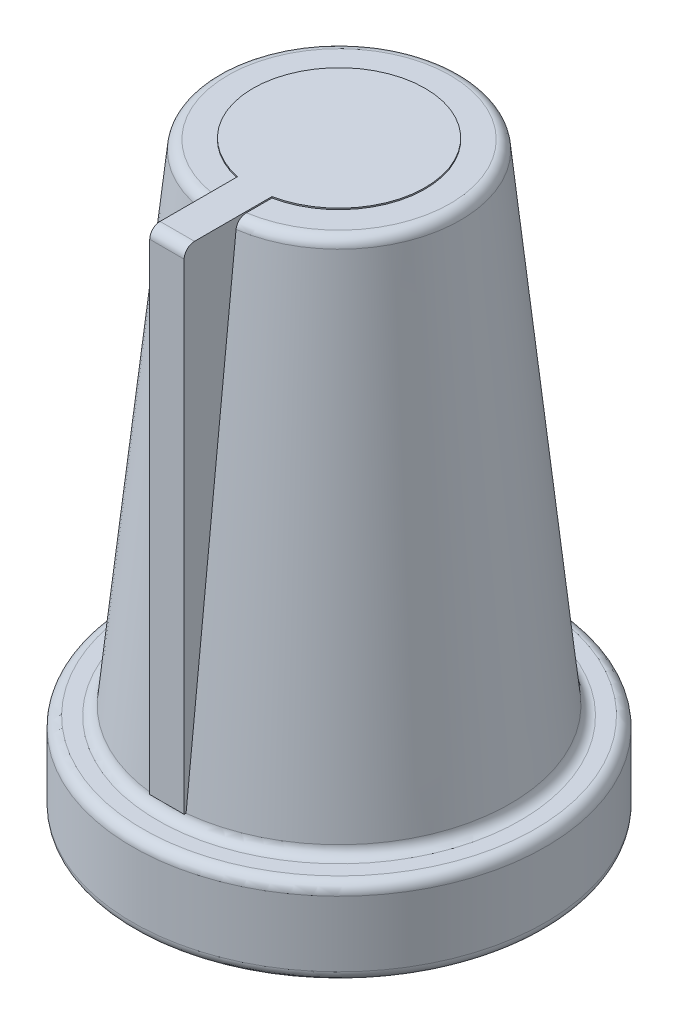
ISO-10303-21;
HEADER;
FILE_DESCRIPTION(('STEP AP214'),'2;1');
FILE_NAME('part.step','',(''),(''),'','','');
FILE_SCHEMA(('AUTOMOTIVE_DESIGN { 1 0 10303 214 1 1 1 1 }'));
ENDSEC;
DATA;
#1=APPLICATION_CONTEXT('core data for automotive mechanical design processes');
#2=APPLICATION_PROTOCOL_DEFINITION('international standard','automotive_design',2000,#1);
#3=PRODUCT_CONTEXT('',#1,'mechanical');
#4=PRODUCT('Part','Part','',(#3));
#5=PRODUCT_RELATED_PRODUCT_CATEGORY('part','',(#4));
#6=PRODUCT_DEFINITION_FORMATION('','',#4);
#7=PRODUCT_DEFINITION_CONTEXT('part definition',#1,'design');
#8=PRODUCT_DEFINITION('design','',#6,#7);
#9=PRODUCT_DEFINITION_SHAPE('','',#8);
#10=(LENGTH_UNIT() NAMED_UNIT(*) SI_UNIT(.MILLI.,.METRE.));
#11=(NAMED_UNIT(*) PLANE_ANGLE_UNIT() SI_UNIT($,.RADIAN.));
#12=(NAMED_UNIT(*) SI_UNIT($,.STERADIAN.) SOLID_ANGLE_UNIT());
#13=UNCERTAINTY_MEASURE_WITH_UNIT(LENGTH_MEASURE(1.E-05),#10,'distance_accuracy_value','');
#14=(GEOMETRIC_REPRESENTATION_CONTEXT(3) GLOBAL_UNCERTAINTY_ASSIGNED_CONTEXT((#13)) GLOBAL_UNIT_ASSIGNED_CONTEXT((#10,
#11,#12)) REPRESENTATION_CONTEXT('',''));
#15=CARTESIAN_POINT('',(0.,0.,0.));
#16=DIRECTION('',(0.,0.,1.));
#17=DIRECTION('',(1.,0.,0.));
#18=AXIS2_PLACEMENT_3D('',#15,#16,#17);
#19=CARTESIAN_POINT('',(0.,10.,0.));
#20=DIRECTION('',(0.,-1.,0.));
#21=DIRECTION('',(0.,0.,-1.));
#22=AXIS2_PLACEMENT_3D('',#19,#20,#21);
#23=PLANE('',#22);
#24=DIRECTION('',(0.,0.,1.));
#25=VECTOR('',#24,1.);
#26=CARTESIAN_POINT('',(-3.,10.,0.));
#27=LINE('',#26,#25);
#28=CARTESIAN_POINT('',(-3.,10.,2.44948974278318));
#29=VERTEX_POINT('',#28);
#30=CARTESIAN_POINT('',(-3.,10.,3.19044893302208));
#31=VERTEX_POINT('',#30);
#32=EDGE_CURVE('E46',#29,#31,#27,.T.);
#33=ORIENTED_EDGE('',*,*,#32,.F.);
#34=CARTESIAN_POINT('',(-2.5,10.,0.));
#35=DIRECTION('',(0.,-1.,0.));
#36=DIRECTION('',(0.,0.,-1.));
#37=AXIS2_PLACEMENT_3D('',#34,#35,#36);
#38=CIRCLE('',#37,2.5);
#39=CARTESIAN_POINT('',(-2.,10.,2.44948974278318));
#40=VERTEX_POINT('',#39);
#41=EDGE_CURVE('E226',#29,#40,#38,.T.);
#42=ORIENTED_EDGE('',*,*,#41,.T.);
#43=DIRECTION('',(0.,0.,-1.));
#44=VECTOR('',#43,1.);
#45=CARTESIAN_POINT('',(-2.,10.,0.));
#46=LINE('',#45,#44);
#47=CARTESIAN_POINT('',(-2.,10.,3.19044893302208));
#48=VERTEX_POINT('',#47);
#49=EDGE_CURVE('E124',#48,#40,#46,.T.);
#50=ORIENTED_EDGE('',*,*,#49,.F.);
#51=CARTESIAN_POINT('',(-2.5,10.,0.));
#52=DIRECTION('',(0.,-1.,0.));
#53=DIRECTION('',(0.,0.,-1.));
#54=AXIS2_PLACEMENT_3D('',#51,#52,#53);
#55=CIRCLE('',#54,3.22939071563379);
#56=EDGE_CURVE('E163',#31,#48,#55,.T.);
#57=ORIENTED_EDGE('',*,*,#56,.F.);
#58=EDGE_LOOP('',(#33,#42,#50,#57));
#59=FACE_BOUND('',#58,.T.);
#60=ADVANCED_FACE('F37',(#59),#23,.F.);
#61=CARTESIAN_POINT('',(-2.5,9.7,0.));
#62=DIRECTION('',(0.,-1.,0.));
#63=DIRECTION('',(0.,0.,-1.));
#64=AXIS2_PLACEMENT_3D('',#61,#62,#63);
#65=TOROIDAL_SURFACE('',#64,3.2293907156338,0.3);
#66=CARTESIAN_POINT('',(-2.,9.80659714473536,2.90627092595592));
#67=CARTESIAN_POINT('',(-2.,9.79107954288905,2.9002863500572));
#68=CARTESIAN_POINT('',(-2.,9.77504808297474,2.89560237405859));
#69=CARTESIAN_POINT('',(-2.,9.74241386718379,2.88898893072874));
#70=CARTESIAN_POINT('',(-2.,9.72581051198507,2.88706244899287));
#71=CARTESIAN_POINT('',(-2.,9.69252055488031,2.88603047368517));
#72=CARTESIAN_POINT('',(-2.,9.67583398345656,2.88692401347683));
#73=CARTESIAN_POINT('',(-2.,9.64285274548175,2.89150241449114));
#74=CARTESIAN_POINT('',(-2.,9.62655799367985,2.89518666274562));
#75=CARTESIAN_POINT('',(-2.,9.59482463577489,2.90522871580636));
#76=CARTESIAN_POINT('',(-2.,9.57938557263475,2.91158507751015));
#77=CARTESIAN_POINT('',(-2.,9.54978074876005,2.926778759478));
#78=CARTESIAN_POINT('',(-2.,9.53561507364576,2.93561624640388));
#79=CARTESIAN_POINT('',(-2.,9.50882792360195,2.95559534741943));
#80=CARTESIAN_POINT('',(-2.,9.49622046827976,2.96675575160609));
#81=CARTESIAN_POINT('',(-2.,9.47302727100841,2.99100940783063));
#82=CARTESIAN_POINT('',(-2.,9.46244166507938,3.00410278980479));
#83=CARTESIAN_POINT('',(-2.,9.44344148390248,3.03203960938277));
#84=CARTESIAN_POINT('',(-2.,9.43505808413229,3.04690425083685));
#85=CARTESIAN_POINT('',(-2.,9.42087264251779,3.07781802599083));
#86=CARTESIAN_POINT('',(-2.,9.41507076947824,3.09386723706917));
#87=CARTESIAN_POINT('',(-2.,9.40614892346205,3.12689460678346));
#88=CARTESIAN_POINT('',(-2.,9.40306077391086,3.14388136831635));
#89=CARTESIAN_POINT('',(-2.,9.399765434898,3.17813240423763));
#90=CARTESIAN_POINT('',(-2.,9.3995583514594,3.19539668881544));
#91=CARTESIAN_POINT('',(-2.,9.40203989339294,3.22979635514038));
#92=CARTESIAN_POINT('',(-2.,9.4047418343585,3.24693077952062));
#93=CARTESIAN_POINT('',(-2.,9.41299399579652,3.28049990997672));
#94=CARTESIAN_POINT('',(-2.,9.41854419166324,3.29693462209599));
#95=CARTESIAN_POINT('',(-2.,9.43232129625537,3.32857287008354));
#96=CARTESIAN_POINT('',(-2.,9.44053874037676,3.34378052529881));
#97=CARTESIAN_POINT('',(-2.,9.459432643321,3.37258326450878));
#98=CARTESIAN_POINT('',(-2.,9.47010899304404,3.38617842000837));
#99=CARTESIAN_POINT('',(-2.,9.49351485433732,3.41123528721718));
#100=CARTESIAN_POINT('',(-2.,9.50622466753077,3.42271539688204));
#101=CARTESIAN_POINT('',(-2.,9.53340897683371,3.44335128650953));
#102=CARTESIAN_POINT('',(-2.,9.54788336869423,3.45250720368397));
#103=CARTESIAN_POINT('',(-2.,9.57802081359236,3.4681333682114));
#104=CARTESIAN_POINT('',(-2.,9.593669647033,3.47463104398561));
#105=CARTESIAN_POINT('',(-2.,9.62584151559273,3.48488289790701));
#106=CARTESIAN_POINT('',(-2.,9.64236450704172,3.48863721296509));
#107=CARTESIAN_POINT('',(-2.,9.67567387985522,3.49326966184609));
#108=CARTESIAN_POINT('',(-2.,9.69245710183501,3.49417053705435));
#109=CARTESIAN_POINT('',(-2.,9.72593532717118,3.49313328349119));
#110=CARTESIAN_POINT('',(-2.,9.74263033266934,3.49119522396557));
#111=CARTESIAN_POINT('',(-2.,9.7754112661128,3.48454766553607));
#112=CARTESIAN_POINT('',(-2.,9.79149872934324,3.47984573061657));
#113=CARTESIAN_POINT('',(-2.,9.82265974772867,3.46781646283782));
#114=CARTESIAN_POINT('',(-2.,9.8377332944407,3.46048910811973));
#115=CARTESIAN_POINT('',(-2.,9.86649561601724,3.44339589312583));
#116=CARTESIAN_POINT('',(-2.,9.88017959494747,3.43362196573282));
#117=CARTESIAN_POINT('',(-2.,9.90572947731311,3.41193303384462));
#118=CARTESIAN_POINT('',(-2.,9.91759531552992,3.4000179525773));
#119=CARTESIAN_POINT('',(-2.,9.93927987615705,3.37428097965713));
#120=CARTESIAN_POINT('',(-2.,9.94908074291233,3.36044404640472));
#121=CARTESIAN_POINT('',(-2.,9.9662487250114,3.33133504911752));
#122=CARTESIAN_POINT('',(-2.,9.97361570249089,3.31606290385005));
#123=CARTESIAN_POINT('',(-2.,9.98578852012221,3.28434459789789));
#124=CARTESIAN_POINT('',(-2.,9.99056650820758,3.26788774738349));
#125=CARTESIAN_POINT('',(-2.,9.99731891533104,3.23440852110048));
#126=CARTESIAN_POINT('',(-2.,9.99929317712394,3.21738611366776));
#127=CARTESIAN_POINT('',(-2.,10.0003947367035,3.18309736472043));
#128=CARTESIAN_POINT('',(-2.,9.99949654231611,3.16583020049259));
#129=CARTESIAN_POINT('',(-2.,9.9948240133196,3.1316897420605));
#130=CARTESIAN_POINT('',(-2.,9.9910496984481,3.11481644515414));
#131=CARTESIAN_POINT('',(-2.,9.98071118401219,3.08189037567392));
#132=CARTESIAN_POINT('',(-2.,9.97413854373954,3.06584025154189));
#133=CARTESIAN_POINT('',(-2.,9.95837684613505,3.03507445613103));
#134=CARTESIAN_POINT('',(-2.,9.94918717612934,3.02035909839979));
#135=CARTESIAN_POINT('',(-2.,9.9284924151483,2.99276469536177));
#136=CARTESIAN_POINT('',(-2.,9.91699808675214,2.97987757311063));
#137=CARTESIAN_POINT('',(-2.,9.89199352423432,2.95625768389604));
#138=CARTESIAN_POINT('',(-2.,9.87848588129159,2.94552218878304));
#139=CARTESIAN_POINT('',(-2.,9.85514884979056,2.93004266787893));
#140=CARTESIAN_POINT('',(-2.,9.84580633992835,2.9245510665485));
#141=CARTESIAN_POINT('',(-2.,9.82658083907848,2.91461293714097));
#142=CARTESIAN_POINT('',(-2.,9.81669785170365,2.91016640207918));
#143=CARTESIAN_POINT('',(-2.,9.80659714473536,2.90627092595592));
#144=B_SPLINE_CURVE_WITH_KNOTS('',3,(#66,#67,#68,#69,#70,#71,#72,#73,#74,#75,#76,#77,#78,#79,
#80,#81,#82,#83,#84,#85,#86,#87,#88,#89,#90,#91,#92,#93,#94,#95,#96,#97,#98,#99,#100,#101,#102,
#103,#104,#105,#106,#107,#108,#109,#110,#111,#112,#113,#114,#115,#116,#117,#118,#119,#120,#121,
#122,#123,#124,#125,#126,#127,#128,#129,#130,#131,#132,#133,#134,#135,#136,#137,#138,#139,#140,
#141,#142,#143),.UNSPECIFIED.,.T.,.F.,(4,2,2,2,2,2,2,2,2,2,2,2,2,2,2,2,2,2,2,2,2,2,2,2,2,2,2,2,
2,2,2,2,2,2,2,2,2,2,4),(0.,0.0498556318695391,0.0997652027243041,0.14965766762013,
0.199539177008407,0.249393781910329,0.299251736440633,0.349529862590244,0.399811370015246,
0.450770395190202,0.501732752061171,0.553285054195704,0.604839253446782,0.656630441015106,
0.708421181172938,0.760030117468943,0.811636764355758,0.862770795133005,0.913901806442036,
0.964491053124979,1.01507777491514,1.06526030209604,1.1154416052715,1.16548621091952,
1.21553123324103,1.26574349493911,1.31595755738157,1.36658945160017,1.41722421330086,
1.46839339735515,1.51956545108728,1.57119289726902,1.62281998915603,1.67460392178552,
1.72639998755232,1.7779595788735,1.82945337591021,1.86190558721202,1.89435758161301),.UNSPECIFIED.);
#145=CARTESIAN_POINT('',(-2.,9.73082278703105,3.49219053996464));
#146=VERTEX_POINT('',#145);
#147=EDGE_CURVE('E142',#146,#48,#144,.T.);
#148=ORIENTED_EDGE('',*,*,#147,.F.);
#149=CARTESIAN_POINT('',(-2.5,9.73082278703105,0.));
#150=DIRECTION('',(0.,-1.,0.));
#151=DIRECTION('',(0.,0.,-1.));
#152=AXIS2_PLACEMENT_3D('',#149,#150,#151);
#153=CIRCLE('',#152,3.52780310780215);
#154=CARTESIAN_POINT('',(-3.,9.73082278703105,3.49219053996464));
#155=VERTEX_POINT('',#154);
#156=EDGE_CURVE('E237',#155,#146,#153,.T.);
#157=ORIENTED_EDGE('',*,*,#156,.F.);
#158=CARTESIAN_POINT('',(-3.,9.80659714473536,2.90627092595592));
#159=CARTESIAN_POINT('',(-3.,9.82233910592254,2.91234369296216));
#160=CARTESIAN_POINT('',(-3.,9.83757528962061,2.9197641034663));
#161=CARTESIAN_POINT('',(-3.,9.8665919492256,2.93707340003797));
#162=CARTESIAN_POINT('',(-3.,9.8803704524328,2.94696557185542));
#163=CARTESIAN_POINT('',(-3.,9.90606353704512,2.96890605100413));
#164=CARTESIAN_POINT('',(-3.,9.91798007319742,2.98095206827678));
#165=CARTESIAN_POINT('',(-3.,9.93964252159488,3.00685216511195));
#166=CARTESIAN_POINT('',(-3.,9.94938894958684,3.02070581382973));
#167=CARTESIAN_POINT('',(-3.,9.96654697818114,3.04997944114713));
#168=CARTESIAN_POINT('',(-3.,9.973933974619,3.06541384078252));
#169=CARTESIAN_POINT('',(-3.,9.98604318243197,3.09729562562512));
#170=CARTESIAN_POINT('',(-3.,9.9907651218682,3.11374311401671));
#171=CARTESIAN_POINT('',(-3.,9.99745399402902,3.14736876078178));
#172=CARTESIAN_POINT('',(-3.,9.99939156144716,3.16455276665542));
#173=CARTESIAN_POINT('',(-3.,10.0003637901154,3.19900304469745));
#174=CARTESIAN_POINT('',(-3.,9.99939837527602,3.21626931901031));
#175=CARTESIAN_POINT('',(-3.,9.99457939984763,3.25044614938137));
#176=CARTESIAN_POINT('',(-3.,9.99071741327966,3.26735551939245));
#177=CARTESIAN_POINT('',(-3.,9.98019549157291,3.30028055448737));
#178=CARTESIAN_POINT('',(-3.,9.97353560984408,3.31629623662451));
#179=CARTESIAN_POINT('',(-3.,9.95763627655503,3.34689153883284));
#180=CARTESIAN_POINT('',(-3.,9.9484097141939,3.36147785428725));
#181=CARTESIAN_POINT('',(-3.,9.92761592659742,3.38887443343399));
#182=CARTESIAN_POINT('',(-3.,9.91604881410048,3.40168478262011));
#183=CARTESIAN_POINT('',(-3.,9.89102266589646,3.42503032748729));
#184=CARTESIAN_POINT('',(-3.,9.87758329479071,3.43558660164077));
#185=CARTESIAN_POINT('',(-3.,9.8491076606696,3.45426491937455));
#186=CARTESIAN_POINT('',(-3.,9.83407149256587,3.46238710752434));
#187=CARTESIAN_POINT('',(-3.,9.80299700441807,3.47587987057707));
#188=CARTESIAN_POINT('',(-3.,9.78697068481448,3.48127808893759));
#189=CARTESIAN_POINT('',(-3.,9.75423592312133,3.48928568272434));
#190=CARTESIAN_POINT('',(-3.,9.73752751220781,3.49189518546532));
#191=CARTESIAN_POINT('',(-3.,9.70402966503821,3.49423790772078));
#192=CARTESIAN_POINT('',(-3.,9.6872416418114,3.49399137693554));
#193=CARTESIAN_POINT('',(-3.,9.65394645872922,3.49067851091755));
#194=CARTESIAN_POINT('',(-3.,9.63743929382066,3.48761222647229));
#195=CARTESIAN_POINT('',(-3.,9.60519881958515,3.47875854586465));
#196=CARTESIAN_POINT('',(-3.,9.58946438437197,3.47297524672809));
#197=CARTESIAN_POINT('',(-3.,9.55918368568942,3.45886057381043));
#198=CARTESIAN_POINT('',(-3.,9.54463743927583,3.45052916346081));
#199=CARTESIAN_POINT('',(-3.,9.51707298846111,3.43151925896952));
#200=CARTESIAN_POINT('',(-3.,9.50406193969162,3.42083039237099));
#201=CARTESIAN_POINT('',(-3.,9.47999914199693,3.39743777694235));
#202=CARTESIAN_POINT('',(-3.,9.46894747445966,3.38473394445697));
#203=CARTESIAN_POINT('',(-3.,9.44900866906952,3.35755071192744));
#204=CARTESIAN_POINT('',(-3.,9.44014200128571,3.34305629921728));
#205=CARTESIAN_POINT('',(-3.,9.42493853306359,3.31279660290074));
#206=CARTESIAN_POINT('',(-3.,9.41860187622881,3.2970312472166));
#207=CARTESIAN_POINT('',(-3.,9.40856909562181,3.26449898683008));
#208=CARTESIAN_POINT('',(-3.,9.40490155563889,3.24772326547568));
#209=CARTESIAN_POINT('',(-3.,9.40041010840627,3.21379527810764));
#210=CARTESIAN_POINT('',(-3.,9.39958634517178,3.19664299306823));
#211=CARTESIAN_POINT('',(-3.,9.40080570655277,3.16230224712349));
#212=CARTESIAN_POINT('',(-3.,9.4028719025548,3.1451146014848));
#213=CARTESIAN_POINT('',(-3.,9.4098552416673,3.11132806172925));
#214=CARTESIAN_POINT('',(-3.,9.41477245813387,3.09472918277289));
#215=CARTESIAN_POINT('',(-3.,9.42733573706,3.06256703011727));
#216=CARTESIAN_POINT('',(-3.,9.4349861448151,3.04700545256113));
#217=CARTESIAN_POINT('',(-3.,9.45280768187299,3.01739888179029));
#218=CARTESIAN_POINT('',(-3.,9.46297875424321,3.00335385433257));
#219=CARTESIAN_POINT('',(-3.,9.48548647135191,2.97728515479003));
#220=CARTESIAN_POINT('',(-3.,9.49780820349624,2.96524861258032));
#221=CARTESIAN_POINT('',(-3.,9.5243200652411,2.94344810448748));
#222=CARTESIAN_POINT('',(-3.,9.53850998905355,2.93368388862676));
#223=CARTESIAN_POINT('',(-3.,9.56815956046341,2.91684107415682));
#224=CARTESIAN_POINT('',(-3.,9.58360036151502,2.90972929872689));
#225=CARTESIAN_POINT('',(-3.,9.61547151706778,2.89823577316051));
#226=CARTESIAN_POINT('',(-3.,9.63190204436552,2.89385450126732));
#227=CARTESIAN_POINT('',(-3.,9.66506239129601,2.88799980563571));
#228=CARTESIAN_POINT('',(-3.,9.68178603298571,2.88649123494713));
#229=CARTESIAN_POINT('',(-3.,9.71523294720304,2.88632494264542));
#230=CARTESIAN_POINT('',(-3.,9.73195619260783,2.88766356133625));
#231=CARTESIAN_POINT('',(-3.,9.75836728426786,2.89204708680595));
#232=CARTESIAN_POINT('',(-3.,9.76821118912431,2.89420305982011));
#233=CARTESIAN_POINT('',(-3.,9.78762914579854,2.89950303605228));
#234=CARTESIAN_POINT('',(-3.,9.79720320026133,2.90264702958228));
#235=CARTESIAN_POINT('',(-3.,9.80659714473536,2.90627092595592));
#236=B_SPLINE_CURVE_WITH_KNOTS('',3,(#158,#159,#160,#161,#162,#163,#164,#165,#166,#167,#168,
#169,#170,#171,#172,#173,#174,#175,#176,#177,#178,#179,#180,#181,#182,#183,#184,#185,#186,#187,
#188,#189,#190,#191,#192,#193,#194,#195,#196,#197,#198,#199,#200,#201,#202,#203,#204,#205,#206,
#207,#208,#209,#210,#211,#212,#213,#214,#215,#216,#217,#218,#219,#220,#221,#222,#223,#224,#225,
#226,#227,#228,#229,#230,#231,#232,#233,#234,#235),.UNSPECIFIED.,.T.,.F.,(4,2,2,2,2,2,2,2,2,2,2,
2,2,2,2,2,2,2,2,2,2,2,2,2,2,2,2,2,2,2,2,2,2,2,2,2,2,2,4),(0.,0.0505807108587324,
0.101229020501536,0.151823795547677,0.202406533400379,0.253500719803999,0.304600118848522,
0.356234578072008,0.407870390687967,0.459656994653379,0.511442610091828,0.562972725658993,
0.614500359740451,0.665522710531416,0.716542030312917,0.767032622156604,0.817520908827177,
0.867651446450065,0.917781081173392,0.967835366132328,1.01789036946525,1.06817016410037,
1.11845204674679,1.16918846827102,1.21992776918733,1.27120275160075,1.32248033065579,
1.37416961810945,1.42586023557571,1.47763340046989,1.52940539610438,1.5808317187318,
1.63225238129552,1.6830063945854,1.73376929486168,1.78390702716896,1.83398035281364,
1.86416446028389,1.89434827179339),.UNSPECIFIED.);
#237=EDGE_CURVE('E137',#31,#155,#236,.T.);
#238=ORIENTED_EDGE('',*,*,#237,.F.);
#239=ORIENTED_EDGE('',*,*,#56,.T.);
#240=EDGE_LOOP('',(#148,#157,#238,#239));
#241=FACE_BOUND('',#240,.T.);
#242=ADVANCED_FACE('F39',(#241),#65,.T.);
#243=CARTESIAN_POINT('',(-2.5,-7.,0.));
#244=DIRECTION('',(0.,-1.,0.));
#245=DIRECTION('',(0.,0.,-1.));
#246=AXIS2_PLACEMENT_3D('',#243,#244,#245);
#247=CYLINDRICAL_SURFACE('',#246,3.);
#248=CARTESIAN_POINT('',(-2.5,-5.,0.));
#249=DIRECTION('',(0.,-1.,0.));
#250=DIRECTION('',(0.,0.,-1.));
#251=AXIS2_PLACEMENT_3D('',#248,#249,#250);
#252=CIRCLE('',#251,3.);
#253=CARTESIAN_POINT('',(-2.5,-5.,-3.));
#254=VERTEX_POINT('',#253);
#255=EDGE_CURVE('E267',#254,#254,#252,.T.);
#256=ORIENTED_EDGE('',*,*,#255,.T.);
#257=EDGE_LOOP('',(#256));
#258=FACE_BOUND('',#257,.T.);
#259=CARTESIAN_POINT('',(-2.5,8.93754676912061,0.));
#260=DIRECTION('',(0.,1.,0.));
#261=DIRECTION('',(0.,0.,1.));
#262=AXIS2_PLACEMENT_3D('',#259,#260,#261);
#263=CIRCLE('',#262,3.);
#264=CARTESIAN_POINT('',(-2.5,8.93754676912061,3.));
#265=VERTEX_POINT('',#264);
#266=EDGE_CURVE('E117',#265,#265,#263,.F.);
#267=ORIENTED_EDGE('',*,*,#266,.F.);
#268=EDGE_LOOP('',(#267));
#269=FACE_BOUND('',#268,.T.);
#270=ADVANCED_FACE('F173',(#258,#269),#247,.F.);
#271=CARTESIAN_POINT('',(-2.5,9.73082278703105,0.));
#272=DIRECTION('',(0.,-1.,0.));
#273=DIRECTION('',(0.,0.,-1.));
#274=AXIS2_PLACEMENT_3D('',#271,#272,#273);
#275=CONICAL_SURFACE('',#274,3.52780310780215,0.102924246839153);
#276=CARTESIAN_POINT('',(-2.,-10.99927987243,5.6469067110615));
#277=CARTESIAN_POINT('',(-2.,-9.56252525721492,5.49792288587475));
#278=CARTESIAN_POINT('',(-2.,-8.12577496863599,5.34889730224219));
#279=CARTESIAN_POINT('',(-2.,-5.25228594525633,5.05072897545301));
#280=CARTESIAN_POINT('',(-2.,-3.81554721046065,4.90158623224771));
#281=CARTESIAN_POINT('',(-2.,-1.66045081683063,4.67775910576684));
#282=CARTESIAN_POINT('',(-2.,-0.942087289629983,4.60313122686343));
#283=CARTESIAN_POINT('',(-2.,0.494635119735027,4.45383150926873));
#284=CARTESIAN_POINT('',(-2.,1.21299400189987,4.37915967058211));
#285=CARTESIAN_POINT('',(-2.,2.64970609301175,4.22976499499284));
#286=CARTESIAN_POINT('',(-2.,3.3680593019615,4.15504215811625));
#287=CARTESIAN_POINT('',(-2.,4.80475974427069,4.00553642211661));
#288=CARTESIAN_POINT('',(-2.,5.52310697762777,3.93075352297087));
#289=CARTESIAN_POINT('',(-2.,7.45244702284827,3.72980531440301));
#290=CARTESIAN_POINT('',(-2.,8.66343305356435,3.60357488545938));
#291=CARTESIAN_POINT('',(-2.,11.0853762814993,3.35084149790562));
#292=CARTESIAN_POINT('',(-2.,12.2963334787275,3.22433853938515));
#293=CARTESIAN_POINT('',(-2.,14.7182042954742,2.97094766086778));
#294=CARTESIAN_POINT('',(-2.,15.9291179151015,2.84405974191225));
#295=CARTESIAN_POINT('',(-2.,18.3508875267245,2.58971864925683));
#296=CARTESIAN_POINT('',(-2.,19.5617435186389,2.46226547478316));
#297=CARTESIAN_POINT('',(-2.,21.3779628171724,2.27041266066078));
#298=CARTESIAN_POINT('',(-2.,21.983361629988,2.20634921088898));
#299=CARTESIAN_POINT('',(-2.,23.1941279553443,2.0779291177061));
#300=CARTESIAN_POINT('',(-2.,23.7994954678962,2.01357247439909));
#301=CARTESIAN_POINT('',(-2.,25.0101865171343,1.88447183662267));
#302=CARTESIAN_POINT('',(-2.,25.6155100540021,1.81972784385725));
#303=CARTESIAN_POINT('',(-2.,26.8261011101762,1.68971030686718));
#304=CARTESIAN_POINT('',(-2.,27.431368629409,1.6244367619588));
#305=CARTESIAN_POINT('',(-2.,28.641831677434,1.49313466477986));
#306=CARTESIAN_POINT('',(-2.,29.2470272049124,1.42710610038819));
#307=CARTESIAN_POINT('',(-2.,30.4572933640125,1.29392935855918));
#308=CARTESIAN_POINT('',(-2.,31.0623639960713,1.22678118510926));
#309=CARTESIAN_POINT('',(-2.,31.9698218860763,1.12469306018614));
#310=CARTESIAN_POINT('',(-2.,32.2722858485477,1.09043573194263));
#311=CARTESIAN_POINT('',(-2.,32.8771433283779,1.02130913357055));
#312=CARTESIAN_POINT('',(-2.,33.1795368458636,0.98643986455277));
#313=CARTESIAN_POINT('',(-2.,33.7842329238386,0.915884559627593));
#314=CARTESIAN_POINT('',(-2.,34.0865354831453,0.880198513528375));
#315=CARTESIAN_POINT('',(-2.,34.6909956849935,0.807605883922298));
#316=CARTESIAN_POINT('',(-2.,34.993153326606,0.770699292694845));
#317=CARTESIAN_POINT('',(-2.,35.2952115049679,0.732980555560951));
#318=B_SPLINE_CURVE_WITH_KNOTS('',3,(#276,#277,#278,#279,#280,#281,#282,#283,#284,#285,#286,
#287,#288,#289,#290,#291,#292,#293,#294,#295,#296,#297,#298,#299,#300,#301,#302,#303,#304,#305,
#306,#307,#308,#309,#310,#311,#312,#313,#314,#315,#316,#317),.UNSPECIFIED.,.F.,.F.,(4,2,2,2,2,2,
2,2,2,2,2,2,2,2,2,2,2,2,2,2,4),(0.,4.33337513764963,8.66675207693888,10.8334406315464,
13.0001289564208,15.1668161757662,17.3335042144824,20.9861459204809,24.6387864247402,
28.2914170567066,31.9440526902321,33.7703895831898,35.5967258279895,37.4230540444761,
39.2493846193978,41.0757445556036,42.9020979887159,43.8152908648989,44.7284820836314,
45.6416847034723,46.5548931009075),.UNSPECIFIED.);
#319=CARTESIAN_POINT('',(-2.,-4.23082278703105,4.94467534192744));
#320=VERTEX_POINT('',#319);
#321=EDGE_CURVE('E162',#320,#146,#318,.T.);
#322=ORIENTED_EDGE('',*,*,#321,.F.);
#323=CARTESIAN_POINT('',(-2.5,-4.23082278703105,0.));
#324=DIRECTION('',(0.,-1.,0.));
#325=DIRECTION('',(0.,0.,-1.));
#326=AXIS2_PLACEMENT_3D('',#323,#324,#325);
#327=CIRCLE('',#326,4.96989076711604);
#328=CARTESIAN_POINT('',(-3.,-4.23082278703105,4.94467534192744));
#329=VERTEX_POINT('',#328);
#330=EDGE_CURVE('E238',#329,#320,#327,.T.);
#331=ORIENTED_EDGE('',*,*,#330,.F.);
#332=CARTESIAN_POINT('',(-3.,-10.99927987243,5.6469067110615));
#333=CARTESIAN_POINT('',(-3.,-9.56252525721492,5.49792288587475));
#334=CARTESIAN_POINT('',(-3.,-8.12577496863599,5.34889730224219));
#335=CARTESIAN_POINT('',(-3.,-5.25228594525633,5.05072897545301));
#336=CARTESIAN_POINT('',(-3.,-3.81554721046065,4.90158623224771));
#337=CARTESIAN_POINT('',(-3.,-1.66045081683063,4.67775910576684));
#338=CARTESIAN_POINT('',(-3.,-0.942087289629983,4.60313122686343));
#339=CARTESIAN_POINT('',(-3.,0.494635119735027,4.45383150926873));
#340=CARTESIAN_POINT('',(-3.,1.21299400189987,4.37915967058211));
#341=CARTESIAN_POINT('',(-3.,2.64970609301175,4.22976499499284));
#342=CARTESIAN_POINT('',(-3.,3.3680593019615,4.15504215811625));
#343=CARTESIAN_POINT('',(-3.,4.80475974427069,4.00553642211661));
#344=CARTESIAN_POINT('',(-3.,5.52310697762777,3.93075352297087));
#345=CARTESIAN_POINT('',(-3.,7.45244702284827,3.72980531440301));
#346=CARTESIAN_POINT('',(-3.,8.66343305356435,3.60357488545938));
#347=CARTESIAN_POINT('',(-3.,11.0853762814993,3.35084149790562));
#348=CARTESIAN_POINT('',(-3.,12.2963334787275,3.22433853938516));
#349=CARTESIAN_POINT('',(-3.,14.7182042954742,2.97094766086778));
#350=CARTESIAN_POINT('',(-3.,15.9291179151015,2.84405974191225));
#351=CARTESIAN_POINT('',(-3.,18.3508875267245,2.58971864925683));
#352=CARTESIAN_POINT('',(-3.,19.5617435186389,2.46226547478316));
#353=CARTESIAN_POINT('',(-3.,21.3779628171724,2.27041266066078));
#354=CARTESIAN_POINT('',(-3.,21.983361629988,2.20634921088898));
#355=CARTESIAN_POINT('',(-3.,23.1941279553443,2.07792911770611));
#356=CARTESIAN_POINT('',(-3.,23.7994954678962,2.01357247439909));
#357=CARTESIAN_POINT('',(-3.,25.0101865171343,1.88447183662267));
#358=CARTESIAN_POINT('',(-3.,25.6155100540021,1.81972784385725));
#359=CARTESIAN_POINT('',(-3.,26.8261011101762,1.68971030686718));
#360=CARTESIAN_POINT('',(-3.,27.431368629409,1.6244367619588));
#361=CARTESIAN_POINT('',(-3.,28.641831677434,1.49313466477986));
#362=CARTESIAN_POINT('',(-3.,29.2470272049124,1.42710610038819));
#363=CARTESIAN_POINT('',(-3.,30.4572933640125,1.29392935855918));
#364=CARTESIAN_POINT('',(-3.,31.0623639960713,1.22678118510926));
#365=CARTESIAN_POINT('',(-3.,31.9698218860763,1.12469306018614));
#366=CARTESIAN_POINT('',(-3.,32.2722858485477,1.09043573194263));
#367=CARTESIAN_POINT('',(-3.,32.8771433283779,1.02130913357055));
#368=CARTESIAN_POINT('',(-3.,33.1795368458636,0.98643986455277));
#369=CARTESIAN_POINT('',(-3.,33.7842329238386,0.915884559627593));
#370=CARTESIAN_POINT('',(-3.,34.0865354831453,0.880198513528376));
#371=CARTESIAN_POINT('',(-3.,34.6909956849935,0.807605883922299));
#372=CARTESIAN_POINT('',(-3.,34.993153326606,0.770699292694847));
#373=CARTESIAN_POINT('',(-3.,35.2952115049679,0.732980555560951));
#374=B_SPLINE_CURVE_WITH_KNOTS('',3,(#332,#333,#334,#335,#336,#337,#338,#339,#340,#341,#342,
#343,#344,#345,#346,#347,#348,#349,#350,#351,#352,#353,#354,#355,#356,#357,#358,#359,#360,#361,
#362,#363,#364,#365,#366,#367,#368,#369,#370,#371,#372,#373),.UNSPECIFIED.,.F.,.F.,(4,2,2,2,2,2,
2,2,2,2,2,2,2,2,2,2,2,2,2,2,4),(0.,4.33337513764963,8.66675207693888,10.8334406315464,
13.0001289564208,15.1668161757662,17.3335042144824,20.9861459204809,24.6387864247402,
28.2914170567066,31.9440526902321,33.7703895831898,35.5967258279895,37.4230540444761,
39.2493846193978,41.0757445556036,42.9020979887159,43.8152908648989,44.7284820836314,
45.6416847034723,46.5548931009076),.UNSPECIFIED.);
#375=EDGE_CURVE('E60',#155,#329,#374,.F.);
#376=ORIENTED_EDGE('',*,*,#375,.F.);
#377=ORIENTED_EDGE('',*,*,#156,.T.);
#378=EDGE_LOOP('',(#322,#331,#376,#377));
#379=FACE_BOUND('',#378,.T.);
#380=ADVANCED_FACE('F168',(#379),#275,.T.);
#381=CARTESIAN_POINT('',(0.,-5.,0.));
#382=DIRECTION('',(0.,1.,0.));
#383=DIRECTION('',(0.,0.,1.));
#384=AXIS2_PLACEMENT_3D('',#381,#382,#383);
#385=PLANE('',#384);
#386=ORIENTED_EDGE('',*,*,#255,.F.);
#387=EDGE_LOOP('',(#386));
#388=FACE_BOUND('',#387,.T.);
#389=CARTESIAN_POINT('',(-2.5,-5.,0.));
#390=DIRECTION('',(0.,-1.,0.));
#391=DIRECTION('',(0.,0.,-1.));
#392=AXIS2_PLACEMENT_3D('',#389,#390,#391);
#393=CIRCLE('',#392,5.2);
#394=CARTESIAN_POINT('',(-2.5,-5.,-5.2));
#395=VERTEX_POINT('',#394);
#396=EDGE_CURVE('E264',#395,#395,#393,.T.);
#397=ORIENTED_EDGE('',*,*,#396,.T.);
#398=EDGE_LOOP('',(#397));
#399=FACE_BOUND('',#398,.T.);
#400=ADVANCED_FACE('F172',(#388,#399),#385,.F.);
#401=CARTESIAN_POINT('',(-2.5,-5.3,0.));
#402=DIRECTION('',(0.,-1.,0.));
#403=DIRECTION('',(0.,0.,-1.));
#404=AXIS2_PLACEMENT_3D('',#401,#402,#403);
#405=TOROIDAL_SURFACE('',#404,5.2,0.3);
#406=ORIENTED_EDGE('',*,*,#396,.F.);
#407=EDGE_LOOP('',(#406));
#408=FACE_BOUND('',#407,.T.);
#409=CARTESIAN_POINT('',(-2.5,-5.3,0.));
#410=DIRECTION('',(0.,-1.,0.));
#411=DIRECTION('',(0.,0.,-1.));
#412=AXIS2_PLACEMENT_3D('',#409,#410,#411);
#413=CIRCLE('',#412,5.5);
#414=CARTESIAN_POINT('',(-2.5,-5.3,-5.5));
#415=VERTEX_POINT('',#414);
#416=EDGE_CURVE('E261',#415,#415,#413,.T.);
#417=ORIENTED_EDGE('',*,*,#416,.T.);
#418=EDGE_LOOP('',(#417));
#419=FACE_BOUND('',#418,.T.);
#420=ADVANCED_FACE('F203',(#408,#419),#405,.F.);
#421=CARTESIAN_POINT('',(-2.5,-7.,0.));
#422=DIRECTION('',(0.,-1.,0.));
#423=DIRECTION('',(0.,0.,-1.));
#424=AXIS2_PLACEMENT_3D('',#421,#422,#423);
#425=CYLINDRICAL_SURFACE('',#424,5.5);
#426=ORIENTED_EDGE('',*,*,#416,.F.);
#427=EDGE_LOOP('',(#426));
#428=FACE_BOUND('',#427,.T.);
#429=CARTESIAN_POINT('',(-2.5,-7.,0.));
#430=DIRECTION('',(0.,-1.,0.));
#431=DIRECTION('',(0.,0.,-1.));
#432=AXIS2_PLACEMENT_3D('',#429,#430,#431);
#433=CIRCLE('',#432,5.5);
#434=CARTESIAN_POINT('',(-2.5,-7.,-5.5));
#435=VERTEX_POINT('',#434);
#436=EDGE_CURVE('E258',#435,#435,#433,.T.);
#437=ORIENTED_EDGE('',*,*,#436,.T.);
#438=EDGE_LOOP('',(#437));
#439=FACE_BOUND('',#438,.T.);
#440=ADVANCED_FACE('F199',(#428,#439),#425,.F.);
#441=CARTESIAN_POINT('',(0.,-7.,0.));
#442=DIRECTION('',(0.,1.,0.));
#443=DIRECTION('',(0.,0.,1.));
#444=AXIS2_PLACEMENT_3D('',#441,#442,#443);
#445=PLANE('',#444);
#446=ORIENTED_EDGE('',*,*,#436,.F.);
#447=EDGE_LOOP('',(#446));
#448=FACE_BOUND('',#447,.T.);
#449=CARTESIAN_POINT('',(-2.5,-7.,0.));
#450=DIRECTION('',(0.,-1.,0.));
#451=DIRECTION('',(0.,0.,-1.));
#452=AXIS2_PLACEMENT_3D('',#449,#450,#451);
#453=CIRCLE('',#452,5.7);
#454=CARTESIAN_POINT('',(-2.5,-7.,-5.7));
#455=VERTEX_POINT('',#454);
#456=EDGE_CURVE('E255',#455,#455,#453,.T.);
#457=ORIENTED_EDGE('',*,*,#456,.T.);
#458=EDGE_LOOP('',(#457));
#459=FACE_BOUND('',#458,.T.);
#460=ADVANCED_FACE('F195',(#448,#459),#445,.F.);
#461=CARTESIAN_POINT('',(-2.5,-6.7,0.));
#462=DIRECTION('',(0.,-1.,0.));
#463=DIRECTION('',(0.,0.,-1.));
#464=AXIS2_PLACEMENT_3D('',#461,#462,#463);
#465=TOROIDAL_SURFACE('',#464,5.7,0.3);
#466=ORIENTED_EDGE('',*,*,#456,.F.);
#467=EDGE_LOOP('',(#466));
#468=FACE_BOUND('',#467,.T.);
#469=CARTESIAN_POINT('',(-2.5,-6.7,0.));
#470=DIRECTION('',(0.,-1.,0.));
#471=DIRECTION('',(0.,0.,-1.));
#472=AXIS2_PLACEMENT_3D('',#469,#470,#471);
#473=CIRCLE('',#472,6.);
#474=CARTESIAN_POINT('',(-2.5,-6.7,-6.));
#475=VERTEX_POINT('',#474);
#476=EDGE_CURVE('E252',#475,#475,#473,.T.);
#477=ORIENTED_EDGE('',*,*,#476,.T.);
#478=EDGE_LOOP('',(#477));
#479=FACE_BOUND('',#478,.T.);
#480=ADVANCED_FACE('F191',(#468,#479),#465,.T.);
#481=CARTESIAN_POINT('',(-2.5,-7.,0.));
#482=DIRECTION('',(0.,-1.,0.));
#483=DIRECTION('',(0.,0.,-1.));
#484=AXIS2_PLACEMENT_3D('',#481,#482,#483);
#485=CYLINDRICAL_SURFACE('',#484,6.);
#486=ORIENTED_EDGE('',*,*,#476,.F.);
#487=EDGE_LOOP('',(#486));
#488=FACE_BOUND('',#487,.T.);
#489=CARTESIAN_POINT('',(-2.5,-4.8,0.));
#490=DIRECTION('',(0.,-1.,0.));
#491=DIRECTION('',(0.,0.,-1.));
#492=AXIS2_PLACEMENT_3D('',#489,#490,#491);
#493=CIRCLE('',#492,6.);
#494=CARTESIAN_POINT('',(-2.5,-4.8,-6.));
#495=VERTEX_POINT('',#494);
#496=EDGE_CURVE('E249',#495,#495,#493,.T.);
#497=ORIENTED_EDGE('',*,*,#496,.T.);
#498=EDGE_LOOP('',(#497));
#499=FACE_BOUND('',#498,.T.);
#500=ADVANCED_FACE('F187',(#488,#499),#485,.T.);
#501=CARTESIAN_POINT('',(-2.5,-4.8,0.));
#502=DIRECTION('',(0.,-1.,0.));
#503=DIRECTION('',(0.,0.,-1.));
#504=AXIS2_PLACEMENT_3D('',#501,#502,#503);
#505=TOROIDAL_SURFACE('',#504,5.7,0.3);
#506=ORIENTED_EDGE('',*,*,#496,.F.);
#507=EDGE_LOOP('',(#506));
#508=FACE_BOUND('',#507,.T.);
#509=CARTESIAN_POINT('',(-2.5,-4.5,0.));
#510=DIRECTION('',(0.,-1.,0.));
#511=DIRECTION('',(0.,0.,-1.));
#512=AXIS2_PLACEMENT_3D('',#509,#510,#511);
#513=CIRCLE('',#512,5.7);
#514=CARTESIAN_POINT('',(-2.5,-4.5,-5.7));
#515=VERTEX_POINT('',#514);
#516=EDGE_CURVE('E246',#515,#515,#513,.T.);
#517=ORIENTED_EDGE('',*,*,#516,.T.);
#518=EDGE_LOOP('',(#517));
#519=FACE_BOUND('',#518,.T.);
#520=ADVANCED_FACE('F183',(#508,#519),#505,.T.);
#521=CARTESIAN_POINT('',(0.,-4.5,0.));
#522=DIRECTION('',(0.,-1.,0.));
#523=DIRECTION('',(0.,0.,-1.));
#524=AXIS2_PLACEMENT_3D('',#521,#522,#523);
#525=PLANE('',#524);
#526=ORIENTED_EDGE('',*,*,#516,.F.);
#527=EDGE_LOOP('',(#526));
#528=FACE_BOUND('',#527,.T.);
#529=CARTESIAN_POINT('',(-2.5,-4.5,0.));
#530=DIRECTION('',(0.,-1.,0.));
#531=DIRECTION('',(0.,0.,-1.));
#532=AXIS2_PLACEMENT_3D('',#529,#530,#531);
#533=CIRCLE('',#532,5.26830315928439);
#534=CARTESIAN_POINT('',(-2.5,-4.5,-5.26830315928439));
#535=VERTEX_POINT('',#534);
#536=EDGE_CURVE('E243',#535,#535,#533,.T.);
#537=ORIENTED_EDGE('',*,*,#536,.T.);
#538=EDGE_LOOP('',(#537));
#539=FACE_BOUND('',#538,.T.);
#540=ADVANCED_FACE('F179',(#528,#539),#525,.F.);
#541=CARTESIAN_POINT('',(-2.5,-4.2,0.));
#542=DIRECTION('',(0.,-1.,0.));
#543=DIRECTION('',(0.,0.,-1.));
#544=AXIS2_PLACEMENT_3D('',#541,#542,#543);
#545=TOROIDAL_SURFACE('',#544,5.26830315928439,0.3);
#546=ORIENTED_EDGE('',*,*,#536,.F.);
#547=EDGE_LOOP('',(#546));
#548=FACE_BOUND('',#547,.T.);
#549=EDGE_CURVE('E239',#320,#329,#327,.T.);
#550=ORIENTED_EDGE('',*,*,#549,.T.);
#551=ORIENTED_EDGE('',*,*,#330,.T.);
#552=EDGE_LOOP('',(#550,#551));
#553=FACE_BOUND('',#552,.T.);
#554=ADVANCED_FACE('F175',(#548,#553),#545,.F.);
#555=CARTESIAN_POINT('',(0.,0.,5.));
#556=DIRECTION('',(0.,0.,-1.));
#557=DIRECTION('',(-1.,0.,0.));
#558=AXIS2_PLACEMENT_3D('',#555,#556,#557);
#559=PLANE('',#558);
#560=DIRECTION('',(0.,1.,0.));
#561=VECTOR('',#560,1.);
#562=CARTESIAN_POINT('',(-2.,-4.23082278703105,5.));
#563=LINE('',#562,#561);
#564=CARTESIAN_POINT('',(-2.,-4.23082278703105,5.));
#565=VERTEX_POINT('',#564);
#566=CARTESIAN_POINT('',(-2.,9.73754676912061,5.));
#567=VERTEX_POINT('',#566);
#568=EDGE_CURVE('E114',#565,#567,#563,.T.);
#569=ORIENTED_EDGE('',*,*,#568,.T.);
#570=DIRECTION('',(1.,0.,0.));
#571=VECTOR('',#570,1.);
#572=CARTESIAN_POINT('',(-12.6,9.73754676912061,5.));
#573=LINE('',#572,#571);
#574=CARTESIAN_POINT('',(-3.,9.73754676912061,5.));
#575=VERTEX_POINT('',#574);
#576=EDGE_CURVE('E101',#575,#567,#573,.T.);
#577=ORIENTED_EDGE('',*,*,#576,.F.);
#578=DIRECTION('',(0.,-1.,0.));
#579=VECTOR('',#578,1.);
#580=CARTESIAN_POINT('',(-3.,-4.23082278703105,5.));
#581=LINE('',#580,#579);
#582=CARTESIAN_POINT('',(-3.,-4.23082278703105,5.));
#583=VERTEX_POINT('',#582);
#584=EDGE_CURVE('E123',#575,#583,#581,.T.);
#585=ORIENTED_EDGE('',*,*,#584,.T.);
#586=DIRECTION('',(1.,0.,0.));
#587=VECTOR('',#586,1.);
#588=CARTESIAN_POINT('',(-3.,-4.23082278703105,5.));
#589=LINE('',#588,#587);
#590=EDGE_CURVE('E121',#583,#565,#589,.T.);
#591=ORIENTED_EDGE('',*,*,#590,.T.);
#592=EDGE_LOOP('',(#569,#577,#585,#591));
#593=FACE_BOUND('',#592,.T.);
#594=ADVANCED_FACE('F119',(#593),#559,.F.);
#595=CARTESIAN_POINT('',(-3.,-4.23082278703105,5.));
#596=DIRECTION('',(0.,1.,0.));
#597=DIRECTION('',(0.,0.,1.));
#598=AXIS2_PLACEMENT_3D('',#595,#596,#597);
#599=PLANE('',#598);
#600=DIRECTION('',(0.,0.,-1.));
#601=VECTOR('',#600,1.);
#602=CARTESIAN_POINT('',(-3.,-4.23082278703105,5.));
#603=LINE('',#602,#601);
#604=EDGE_CURVE('E135',#583,#329,#603,.T.);
#605=ORIENTED_EDGE('',*,*,#604,.T.);
#606=ORIENTED_EDGE('',*,*,#549,.F.);
#607=DIRECTION('',(0.,0.,-1.));
#608=VECTOR('',#607,1.);
#609=CARTESIAN_POINT('',(-2.,-4.23082278703105,5.));
#610=LINE('',#609,#608);
#611=EDGE_CURVE('E133',#565,#320,#610,.T.);
#612=ORIENTED_EDGE('',*,*,#611,.F.);
#613=ORIENTED_EDGE('',*,*,#590,.F.);
#614=EDGE_LOOP('',(#605,#606,#612,#613));
#615=FACE_BOUND('',#614,.T.);
#616=ADVANCED_FACE('F151',(#615),#599,.F.);
#617=CARTESIAN_POINT('',(-3.,-4.23082278703105,5.));
#618=DIRECTION('',(1.,0.,0.));
#619=DIRECTION('',(0.,0.,-1.));
#620=AXIS2_PLACEMENT_3D('',#617,#618,#619);
#621=PLANE('',#620);
#622=ORIENTED_EDGE('',*,*,#584,.F.);
#623=CARTESIAN_POINT('',(-3.,9.73754676912061,4.7));
#624=DIRECTION('',(1.,0.,0.));
#625=DIRECTION('',(0.,0.,-1.));
#626=AXIS2_PLACEMENT_3D('',#623,#624,#625);
#627=CIRCLE('',#626,0.3);
#628=CARTESIAN_POINT('',(-3.,10.0375467691206,4.7));
#629=VERTEX_POINT('',#628);
#630=EDGE_CURVE('E104',#575,#629,#627,.F.);
#631=ORIENTED_EDGE('',*,*,#630,.T.);
#632=DIRECTION('',(0.,0.,1.));
#633=VECTOR('',#632,1.);
#634=CARTESIAN_POINT('',(-3.,10.0375467691206,4.94467534192744));
#635=LINE('',#634,#633);
#636=CARTESIAN_POINT('',(-3.,10.0375467691206,2.44948974278318));
#637=VERTEX_POINT('',#636);
#638=EDGE_CURVE('E291',#637,#629,#635,.T.);
#639=ORIENTED_EDGE('',*,*,#638,.F.);
#640=DIRECTION('',(0.,-1.,0.));
#641=VECTOR('',#640,1.);
#642=CARTESIAN_POINT('',(-3.,10.0375467691206,2.44948974278318));
#643=LINE('',#642,#641);
#644=EDGE_CURVE('E302',#637,#29,#643,.T.);
#645=ORIENTED_EDGE('',*,*,#644,.T.);
#646=ORIENTED_EDGE('',*,*,#32,.T.);
#647=ORIENTED_EDGE('',*,*,#237,.T.);
#648=ORIENTED_EDGE('',*,*,#375,.T.);
#649=ORIENTED_EDGE('',*,*,#604,.F.);
#650=EDGE_LOOP('',(#622,#631,#639,#645,#646,#647,#648,#649));
#651=FACE_BOUND('',#650,.T.);
#652=ADVANCED_FACE('F147',(#651),#621,.F.);
#653=CARTESIAN_POINT('',(-2.,-4.23082278703105,5.));
#654=DIRECTION('',(-1.,0.,0.));
#655=DIRECTION('',(0.,-1.,0.));
#656=AXIS2_PLACEMENT_3D('',#653,#654,#655);
#657=PLANE('',#656);
#658=DIRECTION('',(0.,0.,-1.));
#659=VECTOR('',#658,1.);
#660=CARTESIAN_POINT('',(-2.,10.0375467691206,5.));
#661=LINE('',#660,#659);
#662=CARTESIAN_POINT('',(-2.,10.0375467691206,4.7));
#663=VERTEX_POINT('',#662);
#664=CARTESIAN_POINT('',(-2.,10.0375467691206,2.44948974278318));
#665=VERTEX_POINT('',#664);
#666=EDGE_CURVE('E116',#663,#665,#661,.T.);
#667=ORIENTED_EDGE('',*,*,#666,.F.);
#668=CARTESIAN_POINT('',(-2.,9.73754676912061,4.7));
#669=DIRECTION('',(-1.,0.,0.));
#670=DIRECTION('',(0.,-1.,0.));
#671=AXIS2_PLACEMENT_3D('',#668,#669,#670);
#672=CIRCLE('',#671,0.3);
#673=EDGE_CURVE('E52',#567,#663,#672,.T.);
#674=ORIENTED_EDGE('',*,*,#673,.F.);
#675=ORIENTED_EDGE('',*,*,#568,.F.);
#676=ORIENTED_EDGE('',*,*,#611,.T.);
#677=ORIENTED_EDGE('',*,*,#321,.T.);
#678=ORIENTED_EDGE('',*,*,#147,.T.);
#679=ORIENTED_EDGE('',*,*,#49,.T.);
#680=DIRECTION('',(0.,-1.,0.));
#681=VECTOR('',#680,1.);
#682=CARTESIAN_POINT('',(-2.,10.0375467691206,2.44948974278318));
#683=LINE('',#682,#681);
#684=EDGE_CURVE('E128',#665,#40,#683,.T.);
#685=ORIENTED_EDGE('',*,*,#684,.F.);
#686=EDGE_LOOP('',(#667,#674,#675,#676,#677,#678,#679,#685));
#687=FACE_BOUND('',#686,.T.);
#688=ADVANCED_FACE('F112',(#687),#657,.F.);
#689=CARTESIAN_POINT('',(-2.5,10.0375467691206,0.));
#690=DIRECTION('',(0.,-1.,0.));
#691=DIRECTION('',(0.,0.,-1.));
#692=AXIS2_PLACEMENT_3D('',#689,#690,#691);
#693=CYLINDRICAL_SURFACE('',#692,2.5);
#694=ORIENTED_EDGE('',*,*,#684,.T.);
#695=ORIENTED_EDGE('',*,*,#41,.F.);
#696=ORIENTED_EDGE('',*,*,#644,.F.);
#697=CARTESIAN_POINT('',(-2.5,10.0375467691206,0.));
#698=DIRECTION('',(0.,1.,0.));
#699=DIRECTION('',(0.,0.,1.));
#700=AXIS2_PLACEMENT_3D('',#697,#698,#699);
#701=CIRCLE('',#700,2.5);
#702=EDGE_CURVE('E296',#665,#637,#701,.T.);
#703=ORIENTED_EDGE('',*,*,#702,.F.);
#704=EDGE_LOOP('',(#694,#695,#696,#703));
#705=FACE_BOUND('',#704,.T.);
#706=ADVANCED_FACE('F304',(#705),#693,.T.);
#707=CARTESIAN_POINT('',(-2.5,10.0375467691206,0.));
#708=DIRECTION('',(0.,1.,0.));
#709=DIRECTION('',(0.,0.,1.));
#710=AXIS2_PLACEMENT_3D('',#707,#708,#709);
#711=PLANE('',#710);
#712=DIRECTION('',(1.,0.,0.));
#713=VECTOR('',#712,1.);
#714=CARTESIAN_POINT('',(-12.6,10.0375467691206,4.7));
#715=LINE('',#714,#713);
#716=EDGE_CURVE('E11',#663,#629,#715,.F.);
#717=ORIENTED_EDGE('',*,*,#716,.F.);
#718=ORIENTED_EDGE('',*,*,#666,.T.);
#719=ORIENTED_EDGE('',*,*,#702,.T.);
#720=ORIENTED_EDGE('',*,*,#638,.T.);
#721=EDGE_LOOP('',(#717,#718,#719,#720));
#722=FACE_BOUND('',#721,.T.);
#723=ADVANCED_FACE('F294',(#722),#711,.T.);
#724=CARTESIAN_POINT('',(-12.6,9.73754676912061,4.7));
#725=DIRECTION('',(1.,0.,0.));
#726=DIRECTION('',(0.,1.,0.));
#727=AXIS2_PLACEMENT_3D('',#724,#725,#726);
#728=CYLINDRICAL_SURFACE('',#727,0.3);
#729=ORIENTED_EDGE('',*,*,#576,.T.);
#730=ORIENTED_EDGE('',*,*,#673,.T.);
#731=ORIENTED_EDGE('',*,*,#716,.T.);
#732=ORIENTED_EDGE('',*,*,#630,.F.);
#733=EDGE_LOOP('',(#729,#730,#731,#732));
#734=FACE_BOUND('',#733,.T.);
#735=ADVANCED_FACE('F102',(#734),#728,.T.);
#736=CARTESIAN_POINT('',(0.,8.93754676912061,0.));
#737=DIRECTION('',(0.,1.,0.));
#738=DIRECTION('',(0.,0.,1.));
#739=AXIS2_PLACEMENT_3D('',#736,#737,#738);
#740=PLANE('',#739);
#741=ORIENTED_EDGE('',*,*,#266,.T.);
#742=EDGE_LOOP('',(#741));
#743=FACE_BOUND('',#742,.T.);
#744=ADVANCED_FACE('F214',(#743),#740,.F.);
#745=CLOSED_SHELL('',(#60,#242,#270,#380,#400,#420,#440,#460,#480,#500,#520,#540,#554,#594,#616,
#652,#688,#706,#723,#735,#744));
#746=MANIFOLD_SOLID_BREP('B2',#745);
#747=ADVANCED_BREP_SHAPE_REPRESENTATION('',(#18,#746),#14);
#748=SHAPE_DEFINITION_REPRESENTATION(#9,#747);
ENDSEC;
END-ISO-10303-21;
